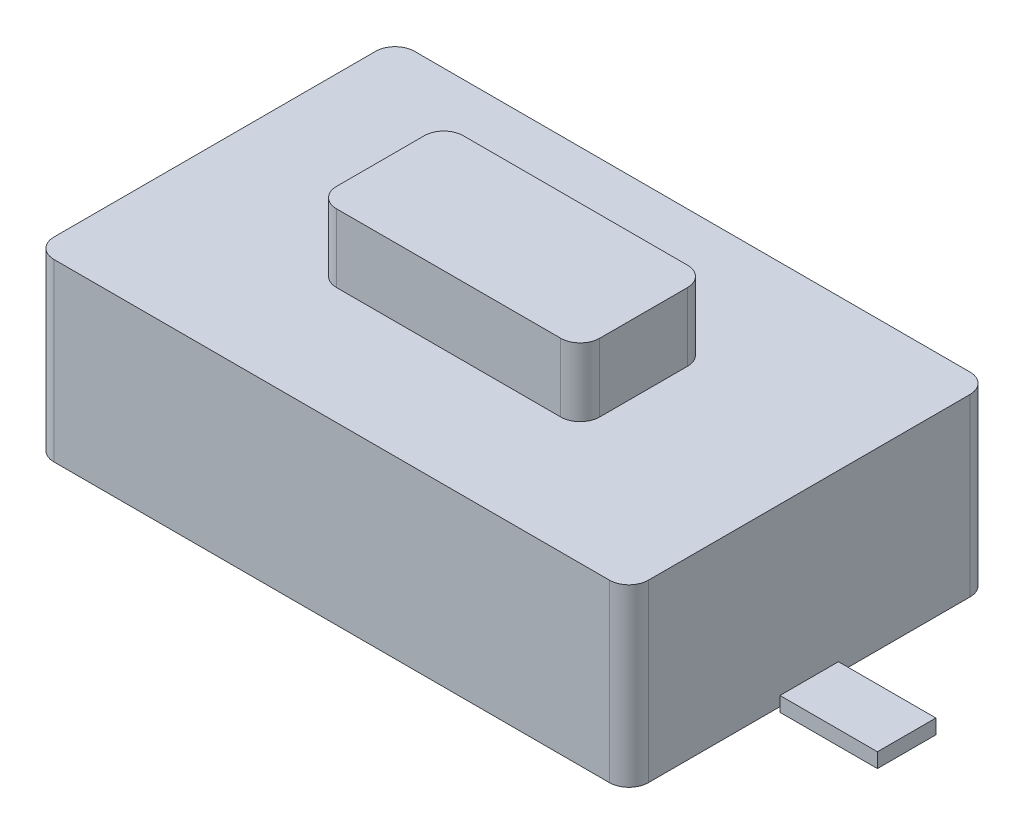
ISO-10303-21;
HEADER;
FILE_DESCRIPTION(('STEP AP214'),'2;1');
FILE_NAME('part.step','',(''),(''),'','','');
FILE_SCHEMA(('AUTOMOTIVE_DESIGN { 1 0 10303 214 1 1 1 1 }'));
ENDSEC;
DATA;
#1=APPLICATION_CONTEXT('core data for automotive mechanical design processes');
#2=APPLICATION_PROTOCOL_DEFINITION('international standard','automotive_design',2000,#1);
#3=PRODUCT_CONTEXT('',#1,'mechanical');
#4=PRODUCT('Part','Part','',(#3));
#5=PRODUCT_RELATED_PRODUCT_CATEGORY('part','',(#4));
#6=PRODUCT_DEFINITION_FORMATION('','',#4);
#7=PRODUCT_DEFINITION_CONTEXT('part definition',#1,'design');
#8=PRODUCT_DEFINITION('design','',#6,#7);
#9=PRODUCT_DEFINITION_SHAPE('','',#8);
#10=(LENGTH_UNIT() NAMED_UNIT(*) SI_UNIT(.MILLI.,.METRE.));
#11=(NAMED_UNIT(*) PLANE_ANGLE_UNIT() SI_UNIT($,.RADIAN.));
#12=(NAMED_UNIT(*) SI_UNIT($,.STERADIAN.) SOLID_ANGLE_UNIT());
#13=UNCERTAINTY_MEASURE_WITH_UNIT(LENGTH_MEASURE(1.E-05),#10,'distance_accuracy_value','');
#14=(GEOMETRIC_REPRESENTATION_CONTEXT(3) GLOBAL_UNCERTAINTY_ASSIGNED_CONTEXT((#13)) GLOBAL_UNIT_ASSIGNED_CONTEXT((#10,
#11,#12)) REPRESENTATION_CONTEXT('',''));
#15=CARTESIAN_POINT('',(0.,0.,0.));
#16=DIRECTION('',(0.,0.,1.));
#17=DIRECTION('',(1.,0.,0.));
#18=AXIS2_PLACEMENT_3D('',#15,#16,#17);
#19=CARTESIAN_POINT('',(0.,1.8,0.));
#20=DIRECTION('',(0.,-1.,0.));
#21=DIRECTION('',(0.,0.,-1.));
#22=AXIS2_PLACEMENT_3D('',#19,#20,#21);
#23=PLANE('',#22);
#24=DIRECTION('',(1.,0.,0.));
#25=VECTOR('',#24,1.);
#26=CARTESIAN_POINT('',(-3.05,1.8,1.85));
#27=LINE('',#26,#25);
#28=CARTESIAN_POINT('',(-2.85,1.8,1.85));
#29=VERTEX_POINT('',#28);
#30=CARTESIAN_POINT('',(2.85,1.8,1.85));
#31=VERTEX_POINT('',#30);
#32=EDGE_CURVE('E367',#29,#31,#27,.T.);
#33=ORIENTED_EDGE('',*,*,#32,.T.);
#34=CARTESIAN_POINT('',(2.85,1.8,1.65));
#35=DIRECTION('',(0.,-1.,0.));
#36=DIRECTION('',(0.,0.,-1.));
#37=AXIS2_PLACEMENT_3D('',#34,#35,#36);
#38=CIRCLE('',#37,0.2);
#39=CARTESIAN_POINT('',(3.05,1.8,1.65));
#40=VERTEX_POINT('',#39);
#41=EDGE_CURVE('E473',#31,#40,#38,.F.);
#42=ORIENTED_EDGE('',*,*,#41,.T.);
#43=DIRECTION('',(0.,0.,-1.));
#44=VECTOR('',#43,1.);
#45=CARTESIAN_POINT('',(3.05,1.8,1.85));
#46=LINE('',#45,#44);
#47=CARTESIAN_POINT('',(3.05,1.8,-1.65));
#48=VERTEX_POINT('',#47);
#49=EDGE_CURVE('E356',#40,#48,#46,.T.);
#50=ORIENTED_EDGE('',*,*,#49,.T.);
#51=CARTESIAN_POINT('',(2.85,1.8,-1.65));
#52=DIRECTION('',(0.,-1.,0.));
#53=DIRECTION('',(0.,0.,-1.));
#54=AXIS2_PLACEMENT_3D('',#51,#52,#53);
#55=CIRCLE('',#54,0.2);
#56=CARTESIAN_POINT('',(2.85,1.8,-1.85));
#57=VERTEX_POINT('',#56);
#58=EDGE_CURVE('E470',#48,#57,#55,.F.);
#59=ORIENTED_EDGE('',*,*,#58,.T.);
#60=DIRECTION('',(-1.,0.,0.));
#61=VECTOR('',#60,1.);
#62=CARTESIAN_POINT('',(-3.05,1.8,-1.85));
#63=LINE('',#62,#61);
#64=CARTESIAN_POINT('',(-2.85,1.8,-1.85));
#65=VERTEX_POINT('',#64);
#66=EDGE_CURVE('E360',#57,#65,#63,.T.);
#67=ORIENTED_EDGE('',*,*,#66,.T.);
#68=CARTESIAN_POINT('',(-2.85,1.8,-1.65));
#69=DIRECTION('',(0.,-1.,0.));
#70=DIRECTION('',(0.,0.,-1.));
#71=AXIS2_PLACEMENT_3D('',#68,#69,#70);
#72=CIRCLE('',#71,0.2);
#73=CARTESIAN_POINT('',(-3.05,1.8,-1.65));
#74=VERTEX_POINT('',#73);
#75=EDGE_CURVE('E65',#65,#74,#72,.F.);
#76=ORIENTED_EDGE('',*,*,#75,.T.);
#77=DIRECTION('',(0.,0.,1.));
#78=VECTOR('',#77,1.);
#79=CARTESIAN_POINT('',(-3.05,1.8,1.85));
#80=LINE('',#79,#78);
#81=CARTESIAN_POINT('',(-3.05,1.8,1.65));
#82=VERTEX_POINT('',#81);
#83=EDGE_CURVE('E364',#74,#82,#80,.T.);
#84=ORIENTED_EDGE('',*,*,#83,.T.);
#85=CARTESIAN_POINT('',(-2.85,1.8,1.65));
#86=DIRECTION('',(0.,-1.,0.));
#87=DIRECTION('',(0.,0.,-1.));
#88=AXIS2_PLACEMENT_3D('',#85,#86,#87);
#89=CIRCLE('',#88,0.2);
#90=EDGE_CURVE('E465',#82,#29,#89,.F.);
#91=ORIENTED_EDGE('',*,*,#90,.T.);
#92=EDGE_LOOP('',(#33,#42,#50,#59,#67,#76,#84,#91));
#93=FACE_BOUND('',#92,.T.);
#94=DIRECTION('',(0.,0.,-1.));
#95=VECTOR('',#94,1.);
#96=CARTESIAN_POINT('',(1.35,1.8,0.65));
#97=LINE('',#96,#95);
#98=CARTESIAN_POINT('',(1.35,1.8,0.45));
#99=VERTEX_POINT('',#98);
#100=CARTESIAN_POINT('',(1.35,1.8,-0.45));
#101=VERTEX_POINT('',#100);
#102=EDGE_CURVE('E322',#99,#101,#97,.T.);
#103=ORIENTED_EDGE('',*,*,#102,.F.);
#104=CARTESIAN_POINT('',(1.15,1.8,0.45));
#105=DIRECTION('',(0.,-1.,0.));
#106=DIRECTION('',(0.,0.,-1.));
#107=AXIS2_PLACEMENT_3D('',#104,#105,#106);
#108=CIRCLE('',#107,0.2);
#109=CARTESIAN_POINT('',(1.15,1.8,0.65));
#110=VERTEX_POINT('',#109);
#111=EDGE_CURVE('E427',#99,#110,#108,.T.);
#112=ORIENTED_EDGE('',*,*,#111,.T.);
#113=DIRECTION('',(1.,0.,0.));
#114=VECTOR('',#113,1.);
#115=CARTESIAN_POINT('',(-1.35,1.8,0.65));
#116=LINE('',#115,#114);
#117=CARTESIAN_POINT('',(-1.15,1.8,0.65));
#118=VERTEX_POINT('',#117);
#119=EDGE_CURVE('E329',#118,#110,#116,.T.);
#120=ORIENTED_EDGE('',*,*,#119,.F.);
#121=CARTESIAN_POINT('',(-1.15,1.8,0.45));
#122=DIRECTION('',(0.,-1.,0.));
#123=DIRECTION('',(0.,0.,-1.));
#124=AXIS2_PLACEMENT_3D('',#121,#122,#123);
#125=CIRCLE('',#124,0.2);
#126=CARTESIAN_POINT('',(-1.35,1.8,0.45));
#127=VERTEX_POINT('',#126);
#128=EDGE_CURVE('E430',#118,#127,#125,.T.);
#129=ORIENTED_EDGE('',*,*,#128,.T.);
#130=DIRECTION('',(0.,0.,1.));
#131=VECTOR('',#130,1.);
#132=CARTESIAN_POINT('',(-1.35,1.8,0.65));
#133=LINE('',#132,#131);
#134=CARTESIAN_POINT('',(-1.35,1.8,-0.45));
#135=VERTEX_POINT('',#134);
#136=EDGE_CURVE('E349',#135,#127,#133,.T.);
#137=ORIENTED_EDGE('',*,*,#136,.F.);
#138=CARTESIAN_POINT('',(-1.15,1.8,-0.45));
#139=DIRECTION('',(0.,-1.,0.));
#140=DIRECTION('',(0.,0.,-1.));
#141=AXIS2_PLACEMENT_3D('',#138,#139,#140);
#142=CIRCLE('',#141,0.2);
#143=CARTESIAN_POINT('',(-1.15,1.8,-0.65));
#144=VERTEX_POINT('',#143);
#145=EDGE_CURVE('E436',#135,#144,#142,.T.);
#146=ORIENTED_EDGE('',*,*,#145,.T.);
#147=DIRECTION('',(-1.,0.,0.));
#148=VECTOR('',#147,1.);
#149=CARTESIAN_POINT('',(-1.35,1.8,-0.65));
#150=LINE('',#149,#148);
#151=CARTESIAN_POINT('',(1.15,1.8,-0.65));
#152=VERTEX_POINT('',#151);
#153=EDGE_CURVE('E345',#152,#144,#150,.T.);
#154=ORIENTED_EDGE('',*,*,#153,.F.);
#155=CARTESIAN_POINT('',(1.15,1.8,-0.45));
#156=DIRECTION('',(0.,-1.,0.));
#157=DIRECTION('',(0.,0.,-1.));
#158=AXIS2_PLACEMENT_3D('',#155,#156,#157);
#159=CIRCLE('',#158,0.2);
#160=EDGE_CURVE('E433',#152,#101,#159,.T.);
#161=ORIENTED_EDGE('',*,*,#160,.T.);
#162=EDGE_LOOP('',(#103,#112,#120,#129,#137,#146,#154,#161));
#163=FACE_BOUND('',#162,.T.);
#164=ADVANCED_FACE('F43',(#93,#163),#23,.F.);
#165=CARTESIAN_POINT('',(3.05,1.8,1.85));
#166=DIRECTION('',(-1.,0.,0.));
#167=DIRECTION('',(0.,0.,1.));
#168=AXIS2_PLACEMENT_3D('',#165,#166,#167);
#169=PLANE('',#168);
#170=ORIENTED_EDGE('',*,*,#49,.F.);
#171=DIRECTION('',(0.,-1.,0.));
#172=VECTOR('',#171,1.);
#173=CARTESIAN_POINT('',(3.05,1.8,1.65));
#174=LINE('',#173,#172);
#175=CARTESIAN_POINT('',(3.05,0.,1.65));
#176=VERTEX_POINT('',#175);
#177=EDGE_CURVE('E442',#40,#176,#174,.T.);
#178=ORIENTED_EDGE('',*,*,#177,.T.);
#179=DIRECTION('',(0.,0.,-1.));
#180=VECTOR('',#179,1.);
#181=CARTESIAN_POINT('',(3.05,0.,1.85));
#182=LINE('',#181,#180);
#183=CARTESIAN_POINT('',(3.05,0.,0.3));
#184=VERTEX_POINT('',#183);
#185=EDGE_CURVE('E371',#176,#184,#182,.T.);
#186=ORIENTED_EDGE('',*,*,#185,.T.);
#187=DIRECTION('',(0.,1.,0.));
#188=VECTOR('',#187,1.);
#189=CARTESIAN_POINT('',(3.05,-0.05,0.3));
#190=LINE('',#189,#188);
#191=CARTESIAN_POINT('',(3.05,0.1,0.3));
#192=VERTEX_POINT('',#191);
#193=EDGE_CURVE('E225',#184,#192,#190,.T.);
#194=ORIENTED_EDGE('',*,*,#193,.T.);
#195=DIRECTION('',(0.,0.,1.));
#196=VECTOR('',#195,1.);
#197=CARTESIAN_POINT('',(3.05,0.1,0.3));
#198=LINE('',#197,#196);
#199=CARTESIAN_POINT('',(3.05,0.1,-0.3));
#200=VERTEX_POINT('',#199);
#201=EDGE_CURVE('E217',#200,#192,#198,.T.);
#202=ORIENTED_EDGE('',*,*,#201,.F.);
#203=DIRECTION('',(0.,1.,0.));
#204=VECTOR('',#203,1.);
#205=CARTESIAN_POINT('',(3.05,-0.05,-0.3));
#206=LINE('',#205,#204);
#207=CARTESIAN_POINT('',(3.05,0.,-0.3));
#208=VERTEX_POINT('',#207);
#209=EDGE_CURVE('E222',#208,#200,#206,.T.);
#210=ORIENTED_EDGE('',*,*,#209,.F.);
#211=CARTESIAN_POINT('',(3.05,0.,-1.65));
#212=VERTEX_POINT('',#211);
#213=EDGE_CURVE('E341',#208,#212,#182,.T.);
#214=ORIENTED_EDGE('',*,*,#213,.T.);
#215=DIRECTION('',(0.,-1.,0.));
#216=VECTOR('',#215,1.);
#217=CARTESIAN_POINT('',(3.05,1.8,-1.65));
#218=LINE('',#217,#216);
#219=EDGE_CURVE('E439',#212,#48,#218,.F.);
#220=ORIENTED_EDGE('',*,*,#219,.T.);
#221=EDGE_LOOP('',(#170,#178,#186,#194,#202,#210,#214,#220));
#222=FACE_BOUND('',#221,.T.);
#223=ADVANCED_FACE('F220',(#222),#169,.F.);
#224=CARTESIAN_POINT('',(-3.05,1.8,-1.85));
#225=DIRECTION('',(0.,0.,1.));
#226=DIRECTION('',(1.,0.,0.));
#227=AXIS2_PLACEMENT_3D('',#224,#225,#226);
#228=PLANE('',#227);
#229=ORIENTED_EDGE('',*,*,#66,.F.);
#230=DIRECTION('',(0.,-1.,0.));
#231=VECTOR('',#230,1.);
#232=CARTESIAN_POINT('',(2.85,1.8,-1.85));
#233=LINE('',#232,#231);
#234=CARTESIAN_POINT('',(2.85,0.,-1.85));
#235=VERTEX_POINT('',#234);
#236=EDGE_CURVE('E479',#57,#235,#233,.T.);
#237=ORIENTED_EDGE('',*,*,#236,.T.);
#238=DIRECTION('',(-1.,0.,0.));
#239=VECTOR('',#238,1.);
#240=CARTESIAN_POINT('',(-3.05,0.,-1.85));
#241=LINE('',#240,#239);
#242=CARTESIAN_POINT('',(-2.85,0.,-1.85));
#243=VERTEX_POINT('',#242);
#244=EDGE_CURVE('E374',#235,#243,#241,.T.);
#245=ORIENTED_EDGE('',*,*,#244,.T.);
#246=DIRECTION('',(0.,-1.,0.));
#247=VECTOR('',#246,1.);
#248=CARTESIAN_POINT('',(-2.85,1.8,-1.85));
#249=LINE('',#248,#247);
#250=EDGE_CURVE('E476',#243,#65,#249,.F.);
#251=ORIENTED_EDGE('',*,*,#250,.T.);
#252=EDGE_LOOP('',(#229,#237,#245,#251));
#253=FACE_BOUND('',#252,.T.);
#254=ADVANCED_FACE('F503',(#253),#228,.F.);
#255=CARTESIAN_POINT('',(-3.05,1.8,1.85));
#256=DIRECTION('',(1.,0.,0.));
#257=DIRECTION('',(0.,0.,-1.));
#258=AXIS2_PLACEMENT_3D('',#255,#256,#257);
#259=PLANE('',#258);
#260=ORIENTED_EDGE('',*,*,#83,.F.);
#261=DIRECTION('',(0.,-1.,0.));
#262=VECTOR('',#261,1.);
#263=CARTESIAN_POINT('',(-3.05,1.8,-1.65));
#264=LINE('',#263,#262);
#265=CARTESIAN_POINT('',(-3.05,0.,-1.65));
#266=VERTEX_POINT('',#265);
#267=EDGE_CURVE('E11',#74,#266,#264,.T.);
#268=ORIENTED_EDGE('',*,*,#267,.T.);
#269=DIRECTION('',(0.,0.,1.));
#270=VECTOR('',#269,1.);
#271=CARTESIAN_POINT('',(-3.05,0.,1.85));
#272=LINE('',#271,#270);
#273=CARTESIAN_POINT('',(-3.05,0.,-0.3));
#274=VERTEX_POINT('',#273);
#275=EDGE_CURVE('E380',#266,#274,#272,.T.);
#276=ORIENTED_EDGE('',*,*,#275,.T.);
#277=DIRECTION('',(0.,1.,0.));
#278=VECTOR('',#277,1.);
#279=CARTESIAN_POINT('',(-3.05,-0.05,-0.3));
#280=LINE('',#279,#278);
#281=CARTESIAN_POINT('',(-3.05,0.1,-0.3));
#282=VERTEX_POINT('',#281);
#283=EDGE_CURVE('E240',#274,#282,#280,.T.);
#284=ORIENTED_EDGE('',*,*,#283,.T.);
#285=DIRECTION('',(0.,0.,1.));
#286=VECTOR('',#285,1.);
#287=CARTESIAN_POINT('',(-3.05,0.1,0.3));
#288=LINE('',#287,#286);
#289=CARTESIAN_POINT('',(-3.05,0.1,0.3));
#290=VERTEX_POINT('',#289);
#291=EDGE_CURVE('E280',#282,#290,#288,.T.);
#292=ORIENTED_EDGE('',*,*,#291,.T.);
#293=DIRECTION('',(0.,1.,0.));
#294=VECTOR('',#293,1.);
#295=CARTESIAN_POINT('',(-3.05,-0.05,0.3));
#296=LINE('',#295,#294);
#297=CARTESIAN_POINT('',(-3.05,0.,0.3));
#298=VERTEX_POINT('',#297);
#299=EDGE_CURVE('E323',#298,#290,#296,.T.);
#300=ORIENTED_EDGE('',*,*,#299,.F.);
#301=CARTESIAN_POINT('',(-3.05,0.,1.65));
#302=VERTEX_POINT('',#301);
#303=EDGE_CURVE('E379',#298,#302,#272,.T.);
#304=ORIENTED_EDGE('',*,*,#303,.T.);
#305=DIRECTION('',(0.,-1.,0.));
#306=VECTOR('',#305,1.);
#307=CARTESIAN_POINT('',(-3.05,1.8,1.65));
#308=LINE('',#307,#306);
#309=EDGE_CURVE('E52',#302,#82,#308,.F.);
#310=ORIENTED_EDGE('',*,*,#309,.T.);
#311=EDGE_LOOP('',(#260,#268,#276,#284,#292,#300,#304,#310));
#312=FACE_BOUND('',#311,.T.);
#313=ADVANCED_FACE('F510',(#312),#259,.F.);
#314=CARTESIAN_POINT('',(-3.05,1.8,1.85));
#315=DIRECTION('',(0.,0.,-1.));
#316=DIRECTION('',(-1.,0.,0.));
#317=AXIS2_PLACEMENT_3D('',#314,#315,#316);
#318=PLANE('',#317);
#319=DIRECTION('',(1.,0.,0.));
#320=VECTOR('',#319,1.);
#321=CARTESIAN_POINT('',(-3.05,0.,1.85));
#322=LINE('',#321,#320);
#323=CARTESIAN_POINT('',(-2.85,0.,1.85));
#324=VERTEX_POINT('',#323);
#325=CARTESIAN_POINT('',(2.85,0.,1.85));
#326=VERTEX_POINT('',#325);
#327=EDGE_CURVE('E361',#324,#326,#322,.T.);
#328=ORIENTED_EDGE('',*,*,#327,.T.);
#329=DIRECTION('',(0.,-1.,0.));
#330=VECTOR('',#329,1.);
#331=CARTESIAN_POINT('',(2.85,1.8,1.85));
#332=LINE('',#331,#330);
#333=EDGE_CURVE('E462',#326,#31,#332,.F.);
#334=ORIENTED_EDGE('',*,*,#333,.T.);
#335=ORIENTED_EDGE('',*,*,#32,.F.);
#336=DIRECTION('',(0.,-1.,0.));
#337=VECTOR('',#336,1.);
#338=CARTESIAN_POINT('',(-2.85,1.8,1.85));
#339=LINE('',#338,#337);
#340=EDGE_CURVE('E458',#29,#324,#339,.T.);
#341=ORIENTED_EDGE('',*,*,#340,.T.);
#342=EDGE_LOOP('',(#328,#334,#335,#341));
#343=FACE_BOUND('',#342,.T.);
#344=ADVANCED_FACE('F560',(#343),#318,.F.);
#345=CARTESIAN_POINT('',(0.,0.,0.));
#346=DIRECTION('',(0.,-1.,0.));
#347=DIRECTION('',(0.,0.,-1.));
#348=AXIS2_PLACEMENT_3D('',#345,#346,#347);
#349=PLANE('',#348);
#350=ORIENTED_EDGE('',*,*,#185,.F.);
#351=CARTESIAN_POINT('',(2.85,0.,1.65));
#352=DIRECTION('',(0.,-1.,0.));
#353=DIRECTION('',(0.,0.,-1.));
#354=AXIS2_PLACEMENT_3D('',#351,#352,#353);
#355=CIRCLE('',#354,0.2);
#356=EDGE_CURVE('E455',#176,#326,#355,.T.);
#357=ORIENTED_EDGE('',*,*,#356,.T.);
#358=ORIENTED_EDGE('',*,*,#327,.F.);
#359=CARTESIAN_POINT('',(-2.85,0.,1.65));
#360=DIRECTION('',(0.,-1.,0.));
#361=DIRECTION('',(0.,0.,-1.));
#362=AXIS2_PLACEMENT_3D('',#359,#360,#361);
#363=CIRCLE('',#362,0.2);
#364=EDGE_CURVE('E446',#324,#302,#363,.T.);
#365=ORIENTED_EDGE('',*,*,#364,.T.);
#366=ORIENTED_EDGE('',*,*,#303,.F.);
#367=EDGE_CURVE('E383',#274,#298,#272,.T.);
#368=ORIENTED_EDGE('',*,*,#367,.F.);
#369=ORIENTED_EDGE('',*,*,#275,.F.);
#370=CARTESIAN_POINT('',(-2.85,0.,-1.65));
#371=DIRECTION('',(0.,-1.,0.));
#372=DIRECTION('',(0.,0.,-1.));
#373=AXIS2_PLACEMENT_3D('',#370,#371,#372);
#374=CIRCLE('',#373,0.2);
#375=EDGE_CURVE('E449',#266,#243,#374,.T.);
#376=ORIENTED_EDGE('',*,*,#375,.T.);
#377=ORIENTED_EDGE('',*,*,#244,.F.);
#378=CARTESIAN_POINT('',(2.85,0.,-1.65));
#379=DIRECTION('',(0.,-1.,0.));
#380=DIRECTION('',(0.,0.,-1.));
#381=AXIS2_PLACEMENT_3D('',#378,#379,#380);
#382=CIRCLE('',#381,0.2);
#383=EDGE_CURVE('E452',#235,#212,#382,.T.);
#384=ORIENTED_EDGE('',*,*,#383,.T.);
#385=ORIENTED_EDGE('',*,*,#213,.F.);
#386=EDGE_CURVE('E375',#184,#208,#182,.T.);
#387=ORIENTED_EDGE('',*,*,#386,.F.);
#388=EDGE_LOOP('',(#350,#357,#358,#365,#366,#368,#369,#376,#377,#384,#385,#387));
#389=FACE_BOUND('',#388,.T.);
#390=ADVANCED_FACE('F513',(#389),#349,.T.);
#391=CARTESIAN_POINT('',(1.35,2.5,0.65));
#392=DIRECTION('',(-1.,0.,0.));
#393=DIRECTION('',(0.,0.,1.));
#394=AXIS2_PLACEMENT_3D('',#391,#392,#393);
#395=PLANE('',#394);
#396=DIRECTION('',(0.,0.,-1.));
#397=VECTOR('',#396,1.);
#398=CARTESIAN_POINT('',(1.35,2.5,0.65));
#399=LINE('',#398,#397);
#400=CARTESIAN_POINT('',(1.35,2.5,0.45));
#401=VERTEX_POINT('',#400);
#402=CARTESIAN_POINT('',(1.35,2.5,-0.45));
#403=VERTEX_POINT('',#402);
#404=EDGE_CURVE('E324',#401,#403,#399,.T.);
#405=ORIENTED_EDGE('',*,*,#404,.F.);
#406=DIRECTION('',(0.,-1.,0.));
#407=VECTOR('',#406,1.);
#408=CARTESIAN_POINT('',(1.35,2.5,0.45));
#409=LINE('',#408,#407);
#410=EDGE_CURVE('E390',#401,#99,#409,.T.);
#411=ORIENTED_EDGE('',*,*,#410,.T.);
#412=ORIENTED_EDGE('',*,*,#102,.T.);
#413=DIRECTION('',(0.,-1.,0.));
#414=VECTOR('',#413,1.);
#415=CARTESIAN_POINT('',(1.35,2.5,-0.45));
#416=LINE('',#415,#414);
#417=EDGE_CURVE('E387',#101,#403,#416,.F.);
#418=ORIENTED_EDGE('',*,*,#417,.T.);
#419=EDGE_LOOP('',(#405,#411,#412,#418));
#420=FACE_BOUND('',#419,.T.);
#421=ADVANCED_FACE('F556',(#420),#395,.F.);
#422=CARTESIAN_POINT('',(-1.35,2.5,-0.65));
#423=DIRECTION('',(0.,0.,1.));
#424=DIRECTION('',(1.,0.,0.));
#425=AXIS2_PLACEMENT_3D('',#422,#423,#424);
#426=PLANE('',#425);
#427=DIRECTION('',(-1.,0.,0.));
#428=VECTOR('',#427,1.);
#429=CARTESIAN_POINT('',(-1.35,2.5,-0.65));
#430=LINE('',#429,#428);
#431=CARTESIAN_POINT('',(1.15,2.5,-0.65));
#432=VERTEX_POINT('',#431);
#433=CARTESIAN_POINT('',(-1.15,2.5,-0.65));
#434=VERTEX_POINT('',#433);
#435=EDGE_CURVE('E328',#432,#434,#430,.T.);
#436=ORIENTED_EDGE('',*,*,#435,.F.);
#437=DIRECTION('',(0.,-1.,0.));
#438=VECTOR('',#437,1.);
#439=CARTESIAN_POINT('',(1.15,2.5,-0.65));
#440=LINE('',#439,#438);
#441=EDGE_CURVE('E423',#432,#152,#440,.T.);
#442=ORIENTED_EDGE('',*,*,#441,.T.);
#443=ORIENTED_EDGE('',*,*,#153,.T.);
#444=DIRECTION('',(0.,-1.,0.));
#445=VECTOR('',#444,1.);
#446=CARTESIAN_POINT('',(-1.15,2.5,-0.65));
#447=LINE('',#446,#445);
#448=EDGE_CURVE('E420',#144,#434,#447,.F.);
#449=ORIENTED_EDGE('',*,*,#448,.T.);
#450=EDGE_LOOP('',(#436,#442,#443,#449));
#451=FACE_BOUND('',#450,.T.);
#452=ADVANCED_FACE('F692',(#451),#426,.F.);
#453=CARTESIAN_POINT('',(-1.35,2.5,0.65));
#454=DIRECTION('',(1.,0.,0.));
#455=DIRECTION('',(0.,0.,-1.));
#456=AXIS2_PLACEMENT_3D('',#453,#454,#455);
#457=PLANE('',#456);
#458=ORIENTED_EDGE('',*,*,#136,.T.);
#459=DIRECTION('',(0.,-1.,0.));
#460=VECTOR('',#459,1.);
#461=CARTESIAN_POINT('',(-1.35,2.5,0.45));
#462=LINE('',#461,#460);
#463=CARTESIAN_POINT('',(-1.35,2.5,0.45));
#464=VERTEX_POINT('',#463);
#465=EDGE_CURVE('E417',#127,#464,#462,.F.);
#466=ORIENTED_EDGE('',*,*,#465,.T.);
#467=DIRECTION('',(0.,0.,1.));
#468=VECTOR('',#467,1.);
#469=CARTESIAN_POINT('',(-1.35,2.5,0.65));
#470=LINE('',#469,#468);
#471=CARTESIAN_POINT('',(-1.35,2.5,-0.45));
#472=VERTEX_POINT('',#471);
#473=EDGE_CURVE('E333',#472,#464,#470,.T.);
#474=ORIENTED_EDGE('',*,*,#473,.F.);
#475=DIRECTION('',(0.,-1.,0.));
#476=VECTOR('',#475,1.);
#477=CARTESIAN_POINT('',(-1.35,2.5,-0.45));
#478=LINE('',#477,#476);
#479=EDGE_CURVE('E413',#472,#135,#478,.T.);
#480=ORIENTED_EDGE('',*,*,#479,.T.);
#481=EDGE_LOOP('',(#458,#466,#474,#480));
#482=FACE_BOUND('',#481,.T.);
#483=ADVANCED_FACE('F703',(#482),#457,.F.);
#484=CARTESIAN_POINT('',(-1.35,2.5,0.65));
#485=DIRECTION('',(0.,0.,-1.));
#486=DIRECTION('',(-1.,0.,0.));
#487=AXIS2_PLACEMENT_3D('',#484,#485,#486);
#488=PLANE('',#487);
#489=ORIENTED_EDGE('',*,*,#119,.T.);
#490=DIRECTION('',(0.,-1.,0.));
#491=VECTOR('',#490,1.);
#492=CARTESIAN_POINT('',(1.15,2.5,0.65));
#493=LINE('',#492,#491);
#494=CARTESIAN_POINT('',(1.15,2.5,0.65));
#495=VERTEX_POINT('',#494);
#496=EDGE_CURVE('E398',#110,#495,#493,.F.);
#497=ORIENTED_EDGE('',*,*,#496,.T.);
#498=DIRECTION('',(1.,0.,0.));
#499=VECTOR('',#498,1.);
#500=CARTESIAN_POINT('',(-1.35,2.5,0.65));
#501=LINE('',#500,#499);
#502=CARTESIAN_POINT('',(-1.15,2.5,0.65));
#503=VERTEX_POINT('',#502);
#504=EDGE_CURVE('E337',#503,#495,#501,.T.);
#505=ORIENTED_EDGE('',*,*,#504,.F.);
#506=DIRECTION('',(0.,-1.,0.));
#507=VECTOR('',#506,1.);
#508=CARTESIAN_POINT('',(-1.15,2.5,0.65));
#509=LINE('',#508,#507);
#510=EDGE_CURVE('E394',#503,#118,#509,.T.);
#511=ORIENTED_EDGE('',*,*,#510,.T.);
#512=EDGE_LOOP('',(#489,#497,#505,#511));
#513=FACE_BOUND('',#512,.T.);
#514=ADVANCED_FACE('F713',(#513),#488,.F.);
#515=CARTESIAN_POINT('',(0.,2.5,0.));
#516=DIRECTION('',(0.,-1.,0.));
#517=DIRECTION('',(0.,0.,-1.));
#518=AXIS2_PLACEMENT_3D('',#515,#516,#517);
#519=PLANE('',#518);
#520=ORIENTED_EDGE('',*,*,#504,.T.);
#521=CARTESIAN_POINT('',(1.15,2.5,0.45));
#522=DIRECTION('',(0.,-1.,0.));
#523=DIRECTION('',(0.,0.,-1.));
#524=AXIS2_PLACEMENT_3D('',#521,#522,#523);
#525=CIRCLE('',#524,0.2);
#526=EDGE_CURVE('E410',#495,#401,#525,.F.);
#527=ORIENTED_EDGE('',*,*,#526,.T.);
#528=ORIENTED_EDGE('',*,*,#404,.T.);
#529=CARTESIAN_POINT('',(1.15,2.5,-0.45));
#530=DIRECTION('',(0.,-1.,0.));
#531=DIRECTION('',(0.,0.,-1.));
#532=AXIS2_PLACEMENT_3D('',#529,#530,#531);
#533=CIRCLE('',#532,0.2);
#534=EDGE_CURVE('E404',#403,#432,#533,.F.);
#535=ORIENTED_EDGE('',*,*,#534,.T.);
#536=ORIENTED_EDGE('',*,*,#435,.T.);
#537=CARTESIAN_POINT('',(-1.15,2.5,-0.45));
#538=DIRECTION('',(0.,-1.,0.));
#539=DIRECTION('',(0.,0.,-1.));
#540=AXIS2_PLACEMENT_3D('',#537,#538,#539);
#541=CIRCLE('',#540,0.2);
#542=EDGE_CURVE('E401',#434,#472,#541,.F.);
#543=ORIENTED_EDGE('',*,*,#542,.T.);
#544=ORIENTED_EDGE('',*,*,#473,.T.);
#545=CARTESIAN_POINT('',(-1.15,2.5,0.45));
#546=DIRECTION('',(0.,-1.,0.));
#547=DIRECTION('',(0.,0.,-1.));
#548=AXIS2_PLACEMENT_3D('',#545,#546,#547);
#549=CIRCLE('',#548,0.2);
#550=EDGE_CURVE('E407',#464,#503,#549,.F.);
#551=ORIENTED_EDGE('',*,*,#550,.T.);
#552=EDGE_LOOP('',(#520,#527,#528,#535,#536,#543,#544,#551));
#553=FACE_BOUND('',#552,.T.);
#554=ADVANCED_FACE('F546',(#553),#519,.F.);
#555=CARTESIAN_POINT('',(-3.05,-0.05,0.3));
#556=DIRECTION('',(-1.,0.,0.));
#557=DIRECTION('',(0.,0.,1.));
#558=AXIS2_PLACEMENT_3D('',#555,#556,#557);
#559=PLANE('',#558);
#560=CARTESIAN_POINT('',(-3.05,-0.05,-0.3));
#561=VERTEX_POINT('',#560);
#562=EDGE_CURVE('E308',#561,#274,#280,.T.);
#563=ORIENTED_EDGE('',*,*,#562,.T.);
#564=ORIENTED_EDGE('',*,*,#367,.T.);
#565=CARTESIAN_POINT('',(-3.05,-0.05,0.3));
#566=VERTEX_POINT('',#565);
#567=EDGE_CURVE('E318',#566,#298,#296,.T.);
#568=ORIENTED_EDGE('',*,*,#567,.F.);
#569=DIRECTION('',(0.,0.,1.));
#570=VECTOR('',#569,1.);
#571=CARTESIAN_POINT('',(-3.05,-0.05,0.3));
#572=LINE('',#571,#570);
#573=EDGE_CURVE('E295',#561,#566,#572,.T.);
#574=ORIENTED_EDGE('',*,*,#573,.F.);
#575=EDGE_LOOP('',(#563,#564,#568,#574));
#576=FACE_BOUND('',#575,.T.);
#577=ADVANCED_FACE('F525',(#576),#559,.F.);
#578=CARTESIAN_POINT('',(-3.05,-0.05,0.3));
#579=DIRECTION('',(0.,0.,-1.));
#580=DIRECTION('',(-1.,0.,0.));
#581=AXIS2_PLACEMENT_3D('',#578,#579,#580);
#582=PLANE('',#581);
#583=ORIENTED_EDGE('',*,*,#567,.T.);
#584=ORIENTED_EDGE('',*,*,#299,.T.);
#585=DIRECTION('',(-1.,0.,0.));
#586=VECTOR('',#585,1.);
#587=CARTESIAN_POINT('',(-3.05,0.1,0.3));
#588=LINE('',#587,#586);
#589=CARTESIAN_POINT('',(-4.05,0.1,0.3));
#590=VERTEX_POINT('',#589);
#591=EDGE_CURVE('E283',#290,#590,#588,.T.);
#592=ORIENTED_EDGE('',*,*,#591,.T.);
#593=DIRECTION('',(0.,1.,0.));
#594=VECTOR('',#593,1.);
#595=CARTESIAN_POINT('',(-4.05,-0.05,0.3));
#596=LINE('',#595,#594);
#597=CARTESIAN_POINT('',(-4.05,-0.05,0.3));
#598=VERTEX_POINT('',#597);
#599=EDGE_CURVE('E315',#598,#590,#596,.T.);
#600=ORIENTED_EDGE('',*,*,#599,.F.);
#601=DIRECTION('',(-1.,0.,0.));
#602=VECTOR('',#601,1.);
#603=CARTESIAN_POINT('',(-3.05,-0.05,0.3));
#604=LINE('',#603,#602);
#605=EDGE_CURVE('E299',#566,#598,#604,.T.);
#606=ORIENTED_EDGE('',*,*,#605,.F.);
#607=EDGE_LOOP('',(#583,#584,#592,#600,#606));
#608=FACE_BOUND('',#607,.T.);
#609=ADVANCED_FACE('F538',(#608),#582,.F.);
#610=CARTESIAN_POINT('',(-4.05,-0.05,0.3));
#611=DIRECTION('',(1.,0.,0.));
#612=DIRECTION('',(0.,0.,-1.));
#613=AXIS2_PLACEMENT_3D('',#610,#611,#612);
#614=PLANE('',#613);
#615=ORIENTED_EDGE('',*,*,#599,.T.);
#616=DIRECTION('',(0.,0.,-1.));
#617=VECTOR('',#616,1.);
#618=CARTESIAN_POINT('',(-4.05,0.1,0.3));
#619=LINE('',#618,#617);
#620=CARTESIAN_POINT('',(-4.05,0.1,-0.3));
#621=VERTEX_POINT('',#620);
#622=EDGE_CURVE('E287',#590,#621,#619,.T.);
#623=ORIENTED_EDGE('',*,*,#622,.T.);
#624=DIRECTION('',(0.,1.,0.));
#625=VECTOR('',#624,1.);
#626=CARTESIAN_POINT('',(-4.05,-0.05,-0.3));
#627=LINE('',#626,#625);
#628=CARTESIAN_POINT('',(-4.05,-0.05,-0.3));
#629=VERTEX_POINT('',#628);
#630=EDGE_CURVE('E312',#629,#621,#627,.T.);
#631=ORIENTED_EDGE('',*,*,#630,.F.);
#632=DIRECTION('',(0.,0.,-1.));
#633=VECTOR('',#632,1.);
#634=CARTESIAN_POINT('',(-4.05,-0.05,0.3));
#635=LINE('',#634,#633);
#636=EDGE_CURVE('E302',#598,#629,#635,.T.);
#637=ORIENTED_EDGE('',*,*,#636,.F.);
#638=EDGE_LOOP('',(#615,#623,#631,#637));
#639=FACE_BOUND('',#638,.T.);
#640=ADVANCED_FACE('F533',(#639),#614,.F.);
#641=CARTESIAN_POINT('',(-3.05,-0.05,-0.3));
#642=DIRECTION('',(0.,0.,1.));
#643=DIRECTION('',(1.,0.,0.));
#644=AXIS2_PLACEMENT_3D('',#641,#642,#643);
#645=PLANE('',#644);
#646=ORIENTED_EDGE('',*,*,#630,.T.);
#647=DIRECTION('',(1.,0.,0.));
#648=VECTOR('',#647,1.);
#649=CARTESIAN_POINT('',(-3.05,0.1,-0.3));
#650=LINE('',#649,#648);
#651=EDGE_CURVE('E291',#621,#282,#650,.T.);
#652=ORIENTED_EDGE('',*,*,#651,.T.);
#653=ORIENTED_EDGE('',*,*,#283,.F.);
#654=ORIENTED_EDGE('',*,*,#562,.F.);
#655=DIRECTION('',(1.,0.,0.));
#656=VECTOR('',#655,1.);
#657=CARTESIAN_POINT('',(-3.05,-0.05,-0.3));
#658=LINE('',#657,#656);
#659=EDGE_CURVE('E305',#629,#561,#658,.T.);
#660=ORIENTED_EDGE('',*,*,#659,.F.);
#661=EDGE_LOOP('',(#646,#652,#653,#654,#660));
#662=FACE_BOUND('',#661,.T.);
#663=ADVANCED_FACE('F520',(#662),#645,.F.);
#664=CARTESIAN_POINT('',(0.,-0.05,0.));
#665=DIRECTION('',(0.,1.,0.));
#666=DIRECTION('',(0.,0.,1.));
#667=AXIS2_PLACEMENT_3D('',#664,#665,#666);
#668=PLANE('',#667);
#669=ORIENTED_EDGE('',*,*,#573,.T.);
#670=ORIENTED_EDGE('',*,*,#605,.T.);
#671=ORIENTED_EDGE('',*,*,#636,.T.);
#672=ORIENTED_EDGE('',*,*,#659,.T.);
#673=EDGE_LOOP('',(#669,#670,#671,#672));
#674=FACE_BOUND('',#673,.T.);
#675=ADVANCED_FACE('F527',(#674),#668,.F.);
#676=CARTESIAN_POINT('',(0.,0.1,0.));
#677=DIRECTION('',(0.,1.,0.));
#678=DIRECTION('',(0.,0.,1.));
#679=AXIS2_PLACEMENT_3D('',#676,#677,#678);
#680=PLANE('',#679);
#681=ORIENTED_EDGE('',*,*,#291,.F.);
#682=ORIENTED_EDGE('',*,*,#651,.F.);
#683=ORIENTED_EDGE('',*,*,#622,.F.);
#684=ORIENTED_EDGE('',*,*,#591,.F.);
#685=EDGE_LOOP('',(#681,#682,#683,#684));
#686=FACE_BOUND('',#685,.T.);
#687=ADVANCED_FACE('F536',(#686),#680,.T.);
#688=CARTESIAN_POINT('',(3.05,-0.05,0.3));
#689=DIRECTION('',(-1.,0.,0.));
#690=DIRECTION('',(0.,0.,1.));
#691=AXIS2_PLACEMENT_3D('',#688,#689,#690);
#692=PLANE('',#691);
#693=CARTESIAN_POINT('',(3.05,-0.05,0.3));
#694=VERTEX_POINT('',#693);
#695=EDGE_CURVE('E269',#694,#184,#190,.T.);
#696=ORIENTED_EDGE('',*,*,#695,.T.);
#697=ORIENTED_EDGE('',*,*,#386,.T.);
#698=CARTESIAN_POINT('',(3.05,-0.05,-0.3));
#699=VERTEX_POINT('',#698);
#700=EDGE_CURVE('E238',#699,#208,#206,.T.);
#701=ORIENTED_EDGE('',*,*,#700,.F.);
#702=DIRECTION('',(0.,0.,1.));
#703=VECTOR('',#702,1.);
#704=CARTESIAN_POINT('',(3.05,-0.05,0.3));
#705=LINE('',#704,#703);
#706=EDGE_CURVE('E254',#699,#694,#705,.T.);
#707=ORIENTED_EDGE('',*,*,#706,.T.);
#708=EDGE_LOOP('',(#696,#697,#701,#707));
#709=FACE_BOUND('',#708,.T.);
#710=ADVANCED_FACE('F606',(#709),#692,.T.);
#711=CARTESIAN_POINT('',(3.05,-0.05,-0.3));
#712=DIRECTION('',(0.,0.,-1.));
#713=DIRECTION('',(-1.,0.,0.));
#714=AXIS2_PLACEMENT_3D('',#711,#712,#713);
#715=PLANE('',#714);
#716=ORIENTED_EDGE('',*,*,#700,.T.);
#717=ORIENTED_EDGE('',*,*,#209,.T.);
#718=DIRECTION('',(-1.,0.,0.));
#719=VECTOR('',#718,1.);
#720=CARTESIAN_POINT('',(3.05,0.1,-0.3));
#721=LINE('',#720,#719);
#722=CARTESIAN_POINT('',(4.05,0.1,-0.3));
#723=VERTEX_POINT('',#722);
#724=EDGE_CURVE('E231',#723,#200,#721,.T.);
#725=ORIENTED_EDGE('',*,*,#724,.F.);
#726=DIRECTION('',(0.,1.,0.));
#727=VECTOR('',#726,1.);
#728=CARTESIAN_POINT('',(4.05,-0.05,-0.3));
#729=LINE('',#728,#727);
#730=CARTESIAN_POINT('',(4.05,-0.05,-0.3));
#731=VERTEX_POINT('',#730);
#732=EDGE_CURVE('E276',#731,#723,#729,.T.);
#733=ORIENTED_EDGE('',*,*,#732,.F.);
#734=DIRECTION('',(-1.,0.,0.));
#735=VECTOR('',#734,1.);
#736=CARTESIAN_POINT('',(3.05,-0.05,-0.3));
#737=LINE('',#736,#735);
#738=EDGE_CURVE('E258',#731,#699,#737,.T.);
#739=ORIENTED_EDGE('',*,*,#738,.T.);
#740=EDGE_LOOP('',(#716,#717,#725,#733,#739));
#741=FACE_BOUND('',#740,.T.);
#742=ADVANCED_FACE('F236',(#741),#715,.T.);
#743=CARTESIAN_POINT('',(4.05,-0.05,0.3));
#744=DIRECTION('',(1.,0.,0.));
#745=DIRECTION('',(0.,0.,-1.));
#746=AXIS2_PLACEMENT_3D('',#743,#744,#745);
#747=PLANE('',#746);
#748=ORIENTED_EDGE('',*,*,#732,.T.);
#749=DIRECTION('',(0.,0.,-1.));
#750=VECTOR('',#749,1.);
#751=CARTESIAN_POINT('',(4.05,0.1,0.3));
#752=LINE('',#751,#750);
#753=CARTESIAN_POINT('',(4.05,0.1,0.3));
#754=VERTEX_POINT('',#753);
#755=EDGE_CURVE('E245',#754,#723,#752,.T.);
#756=ORIENTED_EDGE('',*,*,#755,.F.);
#757=DIRECTION('',(0.,1.,0.));
#758=VECTOR('',#757,1.);
#759=CARTESIAN_POINT('',(4.05,-0.05,0.3));
#760=LINE('',#759,#758);
#761=CARTESIAN_POINT('',(4.05,-0.05,0.3));
#762=VERTEX_POINT('',#761);
#763=EDGE_CURVE('E273',#762,#754,#760,.T.);
#764=ORIENTED_EDGE('',*,*,#763,.F.);
#765=DIRECTION('',(0.,0.,-1.));
#766=VECTOR('',#765,1.);
#767=CARTESIAN_POINT('',(4.05,-0.05,0.3));
#768=LINE('',#767,#766);
#769=EDGE_CURVE('E261',#762,#731,#768,.T.);
#770=ORIENTED_EDGE('',*,*,#769,.T.);
#771=EDGE_LOOP('',(#748,#756,#764,#770));
#772=FACE_BOUND('',#771,.T.);
#773=ADVANCED_FACE('F614',(#772),#747,.T.);
#774=CARTESIAN_POINT('',(3.05,-0.05,0.3));
#775=DIRECTION('',(0.,0.,1.));
#776=DIRECTION('',(1.,0.,0.));
#777=AXIS2_PLACEMENT_3D('',#774,#775,#776);
#778=PLANE('',#777);
#779=ORIENTED_EDGE('',*,*,#763,.T.);
#780=DIRECTION('',(1.,0.,0.));
#781=VECTOR('',#780,1.);
#782=CARTESIAN_POINT('',(3.05,0.1,0.3));
#783=LINE('',#782,#781);
#784=EDGE_CURVE('E249',#192,#754,#783,.T.);
#785=ORIENTED_EDGE('',*,*,#784,.F.);
#786=ORIENTED_EDGE('',*,*,#193,.F.);
#787=ORIENTED_EDGE('',*,*,#695,.F.);
#788=DIRECTION('',(1.,0.,0.));
#789=VECTOR('',#788,1.);
#790=CARTESIAN_POINT('',(3.05,-0.05,0.3));
#791=LINE('',#790,#789);
#792=EDGE_CURVE('E265',#694,#762,#791,.T.);
#793=ORIENTED_EDGE('',*,*,#792,.T.);
#794=EDGE_LOOP('',(#779,#785,#786,#787,#793));
#795=FACE_BOUND('',#794,.T.);
#796=ADVANCED_FACE('F605',(#795),#778,.T.);
#797=CARTESIAN_POINT('',(0.,-0.05,0.));
#798=DIRECTION('',(0.,1.,0.));
#799=DIRECTION('',(0.,0.,1.));
#800=AXIS2_PLACEMENT_3D('',#797,#798,#799);
#801=PLANE('',#800);
#802=ORIENTED_EDGE('',*,*,#706,.F.);
#803=ORIENTED_EDGE('',*,*,#738,.F.);
#804=ORIENTED_EDGE('',*,*,#769,.F.);
#805=ORIENTED_EDGE('',*,*,#792,.F.);
#806=EDGE_LOOP('',(#802,#803,#804,#805));
#807=FACE_BOUND('',#806,.T.);
#808=ADVANCED_FACE('F612',(#807),#801,.F.);
#809=CARTESIAN_POINT('',(0.,0.1,0.));
#810=DIRECTION('',(0.,1.,0.));
#811=DIRECTION('',(0.,0.,1.));
#812=AXIS2_PLACEMENT_3D('',#809,#810,#811);
#813=PLANE('',#812);
#814=ORIENTED_EDGE('',*,*,#201,.T.);
#815=ORIENTED_EDGE('',*,*,#784,.T.);
#816=ORIENTED_EDGE('',*,*,#755,.T.);
#817=ORIENTED_EDGE('',*,*,#724,.T.);
#818=EDGE_LOOP('',(#814,#815,#816,#817));
#819=FACE_BOUND('',#818,.T.);
#820=ADVANCED_FACE('F243',(#819),#813,.T.);
#821=CARTESIAN_POINT('',(1.15,2.5,0.45));
#822=DIRECTION('',(0.,-1.,0.));
#823=DIRECTION('',(0.,0.,-1.));
#824=AXIS2_PLACEMENT_3D('',#821,#822,#823);
#825=CYLINDRICAL_SURFACE('',#824,0.2);
#826=ORIENTED_EDGE('',*,*,#526,.F.);
#827=ORIENTED_EDGE('',*,*,#496,.F.);
#828=ORIENTED_EDGE('',*,*,#111,.F.);
#829=ORIENTED_EDGE('',*,*,#410,.F.);
#830=EDGE_LOOP('',(#826,#827,#828,#829));
#831=FACE_BOUND('',#830,.T.);
#832=ADVANCED_FACE('F568',(#831),#825,.T.);
#833=CARTESIAN_POINT('',(-1.15,2.5,0.45));
#834=DIRECTION('',(0.,-1.,0.));
#835=DIRECTION('',(0.,0.,-1.));
#836=AXIS2_PLACEMENT_3D('',#833,#834,#835);
#837=CYLINDRICAL_SURFACE('',#836,0.2);
#838=ORIENTED_EDGE('',*,*,#550,.F.);
#839=ORIENTED_EDGE('',*,*,#465,.F.);
#840=ORIENTED_EDGE('',*,*,#128,.F.);
#841=ORIENTED_EDGE('',*,*,#510,.F.);
#842=EDGE_LOOP('',(#838,#839,#840,#841));
#843=FACE_BOUND('',#842,.T.);
#844=ADVANCED_FACE('F571',(#843),#837,.T.);
#845=CARTESIAN_POINT('',(1.15,2.5,-0.45));
#846=DIRECTION('',(0.,-1.,0.));
#847=DIRECTION('',(0.,0.,-1.));
#848=AXIS2_PLACEMENT_3D('',#845,#846,#847);
#849=CYLINDRICAL_SURFACE('',#848,0.2);
#850=ORIENTED_EDGE('',*,*,#534,.F.);
#851=ORIENTED_EDGE('',*,*,#417,.F.);
#852=ORIENTED_EDGE('',*,*,#160,.F.);
#853=ORIENTED_EDGE('',*,*,#441,.F.);
#854=EDGE_LOOP('',(#850,#851,#852,#853));
#855=FACE_BOUND('',#854,.T.);
#856=ADVANCED_FACE('F575',(#855),#849,.T.);
#857=CARTESIAN_POINT('',(-1.15,2.5,-0.45));
#858=DIRECTION('',(0.,-1.,0.));
#859=DIRECTION('',(0.,0.,-1.));
#860=AXIS2_PLACEMENT_3D('',#857,#858,#859);
#861=CYLINDRICAL_SURFACE('',#860,0.2);
#862=ORIENTED_EDGE('',*,*,#542,.F.);
#863=ORIENTED_EDGE('',*,*,#448,.F.);
#864=ORIENTED_EDGE('',*,*,#145,.F.);
#865=ORIENTED_EDGE('',*,*,#479,.F.);
#866=EDGE_LOOP('',(#862,#863,#864,#865));
#867=FACE_BOUND('',#866,.T.);
#868=ADVANCED_FACE('F579',(#867),#861,.T.);
#869=CARTESIAN_POINT('',(2.85,1.8,1.65));
#870=DIRECTION('',(0.,-1.,0.));
#871=DIRECTION('',(0.,0.,-1.));
#872=AXIS2_PLACEMENT_3D('',#869,#870,#871);
#873=CYLINDRICAL_SURFACE('',#872,0.2);
#874=ORIENTED_EDGE('',*,*,#41,.F.);
#875=ORIENTED_EDGE('',*,*,#333,.F.);
#876=ORIENTED_EDGE('',*,*,#356,.F.);
#877=ORIENTED_EDGE('',*,*,#177,.F.);
#878=EDGE_LOOP('',(#874,#875,#876,#877));
#879=FACE_BOUND('',#878,.T.);
#880=ADVANCED_FACE('F583',(#879),#873,.T.);
#881=CARTESIAN_POINT('',(2.85,1.8,-1.65));
#882=DIRECTION('',(0.,-1.,0.));
#883=DIRECTION('',(0.,0.,-1.));
#884=AXIS2_PLACEMENT_3D('',#881,#882,#883);
#885=CYLINDRICAL_SURFACE('',#884,0.2);
#886=ORIENTED_EDGE('',*,*,#58,.F.);
#887=ORIENTED_EDGE('',*,*,#219,.F.);
#888=ORIENTED_EDGE('',*,*,#383,.F.);
#889=ORIENTED_EDGE('',*,*,#236,.F.);
#890=EDGE_LOOP('',(#886,#887,#888,#889));
#891=FACE_BOUND('',#890,.T.);
#892=ADVANCED_FACE('F498',(#891),#885,.T.);
#893=CARTESIAN_POINT('',(-2.85,1.8,-1.65));
#894=DIRECTION('',(0.,-1.,0.));
#895=DIRECTION('',(0.,0.,-1.));
#896=AXIS2_PLACEMENT_3D('',#893,#894,#895);
#897=CYLINDRICAL_SURFACE('',#896,0.2);
#898=ORIENTED_EDGE('',*,*,#75,.F.);
#899=ORIENTED_EDGE('',*,*,#250,.F.);
#900=ORIENTED_EDGE('',*,*,#375,.F.);
#901=ORIENTED_EDGE('',*,*,#267,.F.);
#902=EDGE_LOOP('',(#898,#899,#900,#901));
#903=FACE_BOUND('',#902,.T.);
#904=ADVANCED_FACE('F507',(#903),#897,.T.);
#905=CARTESIAN_POINT('',(-2.85,1.8,1.65));
#906=DIRECTION('',(0.,-1.,0.));
#907=DIRECTION('',(0.,0.,-1.));
#908=AXIS2_PLACEMENT_3D('',#905,#906,#907);
#909=CYLINDRICAL_SURFACE('',#908,0.2);
#910=ORIENTED_EDGE('',*,*,#90,.F.);
#911=ORIENTED_EDGE('',*,*,#309,.F.);
#912=ORIENTED_EDGE('',*,*,#364,.F.);
#913=ORIENTED_EDGE('',*,*,#340,.F.);
#914=EDGE_LOOP('',(#910,#911,#912,#913));
#915=FACE_BOUND('',#914,.T.);
#916=ADVANCED_FACE('F45',(#915),#909,.T.);
#917=CLOSED_SHELL('',(#164,#223,#254,#313,#344,#390,#421,#452,#483,#514,#554,#577,#609,#640,
#663,#675,#687,#710,#742,#773,#796,#808,#820,#832,#844,#856,#868,#880,#892,#904,#916));
#918=MANIFOLD_SOLID_BREP('B2',#917);
#919=ADVANCED_BREP_SHAPE_REPRESENTATION('',(#18,#918),#14);
#920=SHAPE_DEFINITION_REPRESENTATION(#9,#919);
ENDSEC;
END-ISO-10303-21;
